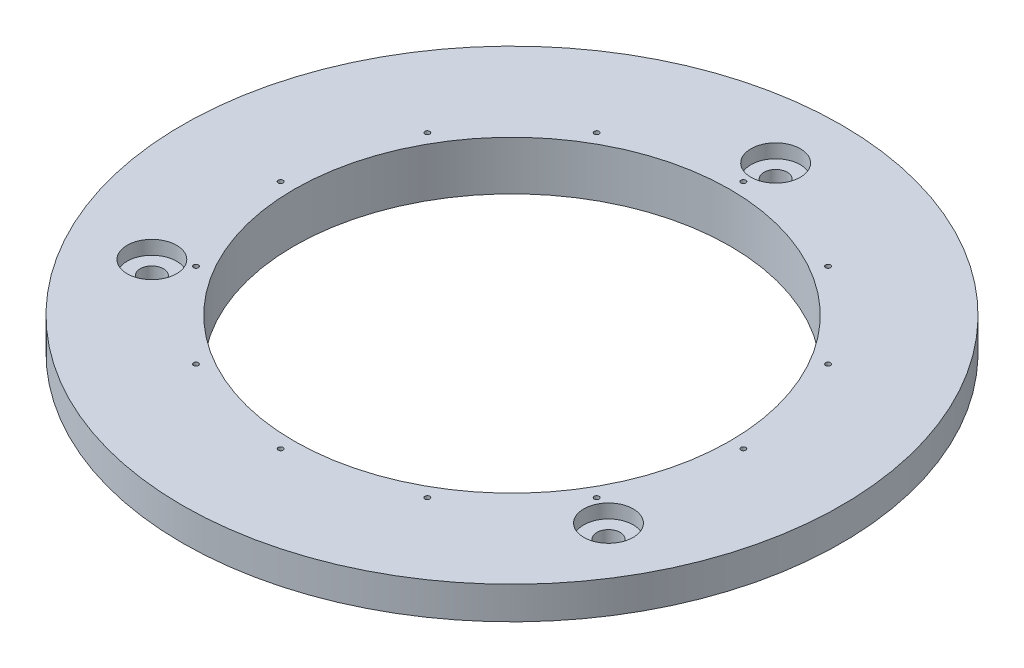
ISO-10303-21;
HEADER;
FILE_DESCRIPTION(('STEP AP214'),'2;1');
FILE_NAME('part.step','',(''),(''),'','','');
FILE_SCHEMA(('AUTOMOTIVE_DESIGN { 1 0 10303 214 1 1 1 1 }'));
ENDSEC;
DATA;
#1=APPLICATION_CONTEXT('core data for automotive mechanical design processes');
#2=APPLICATION_PROTOCOL_DEFINITION('international standard','automotive_design',2000,#1);
#3=PRODUCT_CONTEXT('',#1,'mechanical');
#4=PRODUCT('Part','Part','',(#3));
#5=PRODUCT_RELATED_PRODUCT_CATEGORY('part','',(#4));
#6=PRODUCT_DEFINITION_FORMATION('','',#4);
#7=PRODUCT_DEFINITION_CONTEXT('part definition',#1,'design');
#8=PRODUCT_DEFINITION('design','',#6,#7);
#9=PRODUCT_DEFINITION_SHAPE('','',#8);
#10=(LENGTH_UNIT() NAMED_UNIT(*) SI_UNIT(.MILLI.,.METRE.));
#11=(NAMED_UNIT(*) PLANE_ANGLE_UNIT() SI_UNIT($,.RADIAN.));
#12=(NAMED_UNIT(*) SI_UNIT($,.STERADIAN.) SOLID_ANGLE_UNIT());
#13=UNCERTAINTY_MEASURE_WITH_UNIT(LENGTH_MEASURE(1.E-05),#10,'distance_accuracy_value','');
#14=(GEOMETRIC_REPRESENTATION_CONTEXT(3) GLOBAL_UNCERTAINTY_ASSIGNED_CONTEXT((#13)) GLOBAL_UNIT_ASSIGNED_CONTEXT((#10,
#11,#12)) REPRESENTATION_CONTEXT('',''));
#15=CARTESIAN_POINT('',(0.,0.,0.));
#16=DIRECTION('',(0.,0.,1.));
#17=DIRECTION('',(1.,0.,0.));
#18=AXIS2_PLACEMENT_3D('',#15,#16,#17);
#19=CARTESIAN_POINT('',(0.,0.,0.));
#20=DIRECTION('',(0.,1.,0.));
#21=DIRECTION('',(0.,0.,1.));
#22=AXIS2_PLACEMENT_3D('',#19,#20,#21);
#23=PLANE('',#22);
#24=CARTESIAN_POINT('',(-22.2899357358296,0.,-38.6073011919031));
#25=DIRECTION('',(0.,1.,0.));
#26=DIRECTION('',(0.,0.,1.));
#27=AXIS2_PLACEMENT_3D('',#24,#25,#26);
#28=CIRCLE('',#27,0.475);
#29=CARTESIAN_POINT('',(-22.2899357358296,0.,-38.1323011919031));
#30=VERTEX_POINT('',#29);
#31=EDGE_CURVE('E150',#30,#30,#28,.T.);
#32=ORIENTED_EDGE('',*,*,#31,.T.);
#33=EDGE_LOOP('',(#32));
#34=FACE_BOUND('',#33,.T.);
#35=CARTESIAN_POINT('',(-38.6073011919026,0.,-22.2899357358305));
#36=DIRECTION('',(0.,1.,0.));
#37=DIRECTION('',(0.,0.,1.));
#38=AXIS2_PLACEMENT_3D('',#35,#36,#37);
#39=CIRCLE('',#38,0.474999999999996);
#40=CARTESIAN_POINT('',(-38.6073011919026,0.,-21.8149357358305));
#41=VERTEX_POINT('',#40);
#42=EDGE_CURVE('E154',#41,#41,#39,.T.);
#43=ORIENTED_EDGE('',*,*,#42,.T.);
#44=EDGE_LOOP('',(#43));
#45=FACE_BOUND('',#44,.T.);
#46=CARTESIAN_POINT('',(-44.5798714716601,0.,-4.6694936799398E-13));
#47=DIRECTION('',(0.,1.,0.));
#48=DIRECTION('',(0.,0.,1.));
#49=AXIS2_PLACEMENT_3D('',#46,#47,#48);
#50=CIRCLE('',#49,0.474999999999996);
#51=CARTESIAN_POINT('',(-44.5798714716601,0.,0.474999999999529));
#52=VERTEX_POINT('',#51);
#53=EDGE_CURVE('E158',#52,#52,#50,.T.);
#54=ORIENTED_EDGE('',*,*,#53,.T.);
#55=EDGE_LOOP('',(#54));
#56=FACE_BOUND('',#55,.T.);
#57=CARTESIAN_POINT('',(-38.607301191903,0.,22.2899357358297));
#58=DIRECTION('',(0.,1.,0.));
#59=DIRECTION('',(0.,0.,1.));
#60=AXIS2_PLACEMENT_3D('',#57,#58,#59);
#61=CIRCLE('',#60,0.474999999999996);
#62=CARTESIAN_POINT('',(-38.607301191903,0.,22.7649357358297));
#63=VERTEX_POINT('',#62);
#64=EDGE_CURVE('E162',#63,#63,#61,.T.);
#65=ORIENTED_EDGE('',*,*,#64,.T.);
#66=EDGE_LOOP('',(#65));
#67=FACE_BOUND('',#66,.T.);
#68=CARTESIAN_POINT('',(-22.2899357358304,0.,38.6073011919026));
#69=DIRECTION('',(0.,1.,0.));
#70=DIRECTION('',(0.,0.,1.));
#71=AXIS2_PLACEMENT_3D('',#68,#69,#70);
#72=CIRCLE('',#71,0.475);
#73=CARTESIAN_POINT('',(-22.2899357358304,0.,39.0823011919026));
#74=VERTEX_POINT('',#73);
#75=EDGE_CURVE('E166',#74,#74,#72,.T.);
#76=ORIENTED_EDGE('',*,*,#75,.T.);
#77=EDGE_LOOP('',(#76));
#78=FACE_BOUND('',#77,.T.);
#79=CARTESIAN_POINT('',(0.,0.,44.5798714716601));
#80=DIRECTION('',(0.,1.,0.));
#81=DIRECTION('',(0.,0.,1.));
#82=AXIS2_PLACEMENT_3D('',#79,#80,#81);
#83=CIRCLE('',#82,0.474999999999998);
#84=CARTESIAN_POINT('',(0.,0.,45.0548714716601));
#85=VERTEX_POINT('',#84);
#86=EDGE_CURVE('E170',#85,#85,#83,.T.);
#87=ORIENTED_EDGE('',*,*,#86,.T.);
#88=EDGE_LOOP('',(#87));
#89=FACE_BOUND('',#88,.T.);
#90=CARTESIAN_POINT('',(22.2899357358298,0.,38.6073011919029));
#91=DIRECTION('',(0.,1.,0.));
#92=DIRECTION('',(0.,0.,1.));
#93=AXIS2_PLACEMENT_3D('',#90,#91,#92);
#94=CIRCLE('',#93,0.475);
#95=CARTESIAN_POINT('',(22.2899357358298,0.,39.0823011919029));
#96=VERTEX_POINT('',#95);
#97=EDGE_CURVE('E174',#96,#96,#94,.T.);
#98=ORIENTED_EDGE('',*,*,#97,.T.);
#99=EDGE_LOOP('',(#98));
#100=FACE_BOUND('',#99,.T.);
#101=CARTESIAN_POINT('',(38.6073011919027,0.,22.2899357358302));
#102=DIRECTION('',(0.,1.,0.));
#103=DIRECTION('',(0.,0.,1.));
#104=AXIS2_PLACEMENT_3D('',#101,#102,#103);
#105=CIRCLE('',#104,0.474999999999996);
#106=CARTESIAN_POINT('',(38.6073011919027,0.,22.7649357358302));
#107=VERTEX_POINT('',#106);
#108=EDGE_CURVE('E178',#107,#107,#105,.T.);
#109=ORIENTED_EDGE('',*,*,#108,.T.);
#110=EDGE_LOOP('',(#109));
#111=FACE_BOUND('',#110,.T.);
#112=CARTESIAN_POINT('',(44.5798714716601,0.,1.55649789331327E-13));
#113=DIRECTION('',(0.,1.,0.));
#114=DIRECTION('',(0.,0.,1.));
#115=AXIS2_PLACEMENT_3D('',#112,#113,#114);
#116=CIRCLE('',#115,0.474999999999996);
#117=CARTESIAN_POINT('',(44.5798714716601,0.,0.475000000000152));
#118=VERTEX_POINT('',#117);
#119=EDGE_CURVE('E182',#118,#118,#116,.T.);
#120=ORIENTED_EDGE('',*,*,#119,.T.);
#121=EDGE_LOOP('',(#120));
#122=FACE_BOUND('',#121,.T.);
#123=CARTESIAN_POINT('',(38.6073011919029,0.,-22.28993573583));
#124=DIRECTION('',(0.,1.,0.));
#125=DIRECTION('',(0.,0.,1.));
#126=AXIS2_PLACEMENT_3D('',#123,#124,#125);
#127=CIRCLE('',#126,0.474999999999996);
#128=CARTESIAN_POINT('',(38.6073011919029,0.,-21.81493573583));
#129=VERTEX_POINT('',#128);
#130=EDGE_CURVE('E186',#129,#129,#127,.T.);
#131=ORIENTED_EDGE('',*,*,#130,.T.);
#132=EDGE_LOOP('',(#131));
#133=FACE_BOUND('',#132,.T.);
#134=CARTESIAN_POINT('',(22.2899357358301,0.,-38.6073011919028));
#135=DIRECTION('',(0.,1.,0.));
#136=DIRECTION('',(0.,0.,1.));
#137=AXIS2_PLACEMENT_3D('',#134,#135,#136);
#138=CIRCLE('',#137,0.475);
#139=CARTESIAN_POINT('',(22.2899357358301,0.,-38.1323011919028));
#140=VERTEX_POINT('',#139);
#141=EDGE_CURVE('E190',#140,#140,#138,.T.);
#142=ORIENTED_EDGE('',*,*,#141,.T.);
#143=EDGE_LOOP('',(#142));
#144=FACE_BOUND('',#143,.T.);
#145=CARTESIAN_POINT('',(0.,0.,-44.5798714716601));
#146=DIRECTION('',(0.,1.,0.));
#147=DIRECTION('',(0.,0.,1.));
#148=AXIS2_PLACEMENT_3D('',#145,#146,#147);
#149=CIRCLE('',#148,0.474999999999998);
#150=CARTESIAN_POINT('',(0.,0.,-44.1048714716601));
#151=VERTEX_POINT('',#150);
#152=EDGE_CURVE('E194',#151,#151,#149,.T.);
#153=ORIENTED_EDGE('',*,*,#152,.T.);
#154=EDGE_LOOP('',(#153));
#155=FACE_BOUND('',#154,.T.);
#156=CARTESIAN_POINT('',(-43.9940905122497,0.,25.3999999999996));
#157=DIRECTION('',(0.,1.,0.));
#158=DIRECTION('',(0.,0.,1.));
#159=AXIS2_PLACEMENT_3D('',#156,#157,#158);
#160=CIRCLE('',#159,2.24789999999991);
#161=CARTESIAN_POINT('',(-43.9940905122497,0.,27.6478999999995));
#162=VERTEX_POINT('',#161);
#163=EDGE_CURVE('E50',#162,#162,#160,.T.);
#164=ORIENTED_EDGE('',*,*,#163,.T.);
#165=EDGE_LOOP('',(#164));
#166=FACE_BOUND('',#165,.T.);
#167=CARTESIAN_POINT('',(43.9940905122494,0.,25.4000000000002));
#168=DIRECTION('',(0.,1.,0.));
#169=DIRECTION('',(0.,0.,1.));
#170=AXIS2_PLACEMENT_3D('',#167,#168,#169);
#171=CIRCLE('',#170,2.24789999999991);
#172=CARTESIAN_POINT('',(43.9940905122494,0.,27.6479000000001));
#173=VERTEX_POINT('',#172);
#174=EDGE_CURVE('E72',#173,#173,#171,.T.);
#175=ORIENTED_EDGE('',*,*,#174,.T.);
#176=EDGE_LOOP('',(#175));
#177=FACE_BOUND('',#176,.T.);
#178=CARTESIAN_POINT('',(0.,0.,-50.8));
#179=DIRECTION('',(0.,1.,0.));
#180=DIRECTION('',(0.,0.,1.));
#181=AXIS2_PLACEMENT_3D('',#178,#179,#180);
#182=CIRCLE('',#181,2.24789999999991);
#183=CARTESIAN_POINT('',(0.,0.,-48.5521000000001));
#184=VERTEX_POINT('',#183);
#185=EDGE_CURVE('E67',#184,#184,#182,.T.);
#186=ORIENTED_EDGE('',*,*,#185,.T.);
#187=EDGE_LOOP('',(#186));
#188=FACE_BOUND('',#187,.T.);
#189=CARTESIAN_POINT('',(0.,0.,0.));
#190=DIRECTION('',(0.,1.,0.));
#191=DIRECTION('',(0.,0.,1.));
#192=AXIS2_PLACEMENT_3D('',#189,#190,#191);
#193=CIRCLE('',#192,42.0000049);
#194=CARTESIAN_POINT('',(0.,0.,42.0000049));
#195=VERTEX_POINT('',#194);
#196=EDGE_CURVE('E63',#195,#195,#193,.T.);
#197=ORIENTED_EDGE('',*,*,#196,.T.);
#198=EDGE_LOOP('',(#197));
#199=FACE_BOUND('',#198,.T.);
#200=CARTESIAN_POINT('',(0.,0.,0.));
#201=DIRECTION('',(0.,-1.,0.));
#202=DIRECTION('',(0.,0.,-1.));
#203=AXIS2_PLACEMENT_3D('',#200,#201,#202);
#204=CIRCLE('',#203,58.5911638987099);
#205=CARTESIAN_POINT('',(0.,0.,-58.5911638987099));
#206=VERTEX_POINT('',#205);
#207=EDGE_CURVE('E112',#206,#206,#204,.T.);
#208=ORIENTED_EDGE('',*,*,#207,.T.);
#209=EDGE_LOOP('',(#208));
#210=FACE_BOUND('',#209,.T.);
#211=ADVANCED_FACE('F46',(#34,#45,#56,#67,#78,#89,#100,#111,#122,#133,#144,#155,#166,#177,#188,
#199,#210),#23,.F.);
#212=CARTESIAN_POINT('',(0.,9.449999896,0.));
#213=DIRECTION('',(0.,1.,0.));
#214=DIRECTION('',(0.,0.,1.));
#215=AXIS2_PLACEMENT_3D('',#212,#213,#214);
#216=PLANE('',#215);
#217=CARTESIAN_POINT('',(-22.2899357358296,9.449999896,-38.6073011919031));
#218=DIRECTION('',(0.,1.,0.));
#219=DIRECTION('',(0.,0.,1.));
#220=AXIS2_PLACEMENT_3D('',#217,#218,#219);
#221=CIRCLE('',#220,0.474999999999986);
#222=CARTESIAN_POINT('',(-22.2899357358296,9.449999896,-38.1323011919031));
#223=VERTEX_POINT('',#222);
#224=EDGE_CURVE('E293',#223,#223,#221,.T.);
#225=ORIENTED_EDGE('',*,*,#224,.F.);
#226=EDGE_LOOP('',(#225));
#227=FACE_BOUND('',#226,.T.);
#228=CARTESIAN_POINT('',(-38.6073011919026,9.449999896,-22.2899357358305));
#229=DIRECTION('',(0.,1.,0.));
#230=DIRECTION('',(0.,0.,1.));
#231=AXIS2_PLACEMENT_3D('',#228,#229,#230);
#232=CIRCLE('',#231,0.474999999999989);
#233=CARTESIAN_POINT('',(-38.6073011919026,9.449999896,-21.8149357358305));
#234=VERTEX_POINT('',#233);
#235=EDGE_CURVE('E299',#234,#234,#232,.T.);
#236=ORIENTED_EDGE('',*,*,#235,.F.);
#237=EDGE_LOOP('',(#236));
#238=FACE_BOUND('',#237,.T.);
#239=CARTESIAN_POINT('',(-44.5798714716601,9.449999896,-4.6694936799398E-13));
#240=DIRECTION('',(0.,1.,0.));
#241=DIRECTION('',(0.,0.,1.));
#242=AXIS2_PLACEMENT_3D('',#239,#240,#241);
#243=CIRCLE('',#242,0.474999999999989);
#244=CARTESIAN_POINT('',(-44.5798714716601,9.449999896,0.474999999999522));
#245=VERTEX_POINT('',#244);
#246=EDGE_CURVE('E307',#245,#245,#243,.T.);
#247=ORIENTED_EDGE('',*,*,#246,.F.);
#248=EDGE_LOOP('',(#247));
#249=FACE_BOUND('',#248,.T.);
#250=CARTESIAN_POINT('',(-38.607301191903,9.449999896,22.2899357358297));
#251=DIRECTION('',(0.,1.,0.));
#252=DIRECTION('',(0.,0.,1.));
#253=AXIS2_PLACEMENT_3D('',#250,#251,#252);
#254=CIRCLE('',#253,0.474999999999989);
#255=CARTESIAN_POINT('',(-38.607301191903,9.449999896,22.7649357358297));
#256=VERTEX_POINT('',#255);
#257=EDGE_CURVE('E313',#256,#256,#254,.T.);
#258=ORIENTED_EDGE('',*,*,#257,.F.);
#259=EDGE_LOOP('',(#258));
#260=FACE_BOUND('',#259,.T.);
#261=CARTESIAN_POINT('',(-22.2899357358304,9.449999896,38.6073011919026));
#262=DIRECTION('',(0.,1.,0.));
#263=DIRECTION('',(0.,0.,1.));
#264=AXIS2_PLACEMENT_3D('',#261,#262,#263);
#265=CIRCLE('',#264,0.474999999999986);
#266=CARTESIAN_POINT('',(-22.2899357358304,9.449999896,39.0823011919026));
#267=VERTEX_POINT('',#266);
#268=EDGE_CURVE('E319',#267,#267,#265,.T.);
#269=ORIENTED_EDGE('',*,*,#268,.F.);
#270=EDGE_LOOP('',(#269));
#271=FACE_BOUND('',#270,.T.);
#272=CARTESIAN_POINT('',(0.,9.449999896,44.5798714716601));
#273=DIRECTION('',(0.,1.,0.));
#274=DIRECTION('',(0.,0.,1.));
#275=AXIS2_PLACEMENT_3D('',#272,#273,#274);
#276=CIRCLE('',#275,0.474999999999988);
#277=CARTESIAN_POINT('',(0.,9.449999896,45.0548714716601));
#278=VERTEX_POINT('',#277);
#279=EDGE_CURVE('E325',#278,#278,#276,.T.);
#280=ORIENTED_EDGE('',*,*,#279,.F.);
#281=EDGE_LOOP('',(#280));
#282=FACE_BOUND('',#281,.T.);
#283=CARTESIAN_POINT('',(22.2899357358298,9.449999896,38.6073011919029));
#284=DIRECTION('',(0.,1.,0.));
#285=DIRECTION('',(0.,0.,1.));
#286=AXIS2_PLACEMENT_3D('',#283,#284,#285);
#287=CIRCLE('',#286,0.474999999999986);
#288=CARTESIAN_POINT('',(22.2899357358298,9.449999896,39.0823011919029));
#289=VERTEX_POINT('',#288);
#290=EDGE_CURVE('E331',#289,#289,#287,.T.);
#291=ORIENTED_EDGE('',*,*,#290,.F.);
#292=EDGE_LOOP('',(#291));
#293=FACE_BOUND('',#292,.T.);
#294=CARTESIAN_POINT('',(38.6073011919027,9.449999896,22.2899357358302));
#295=DIRECTION('',(0.,1.,0.));
#296=DIRECTION('',(0.,0.,1.));
#297=AXIS2_PLACEMENT_3D('',#294,#295,#296);
#298=CIRCLE('',#297,0.474999999999989);
#299=CARTESIAN_POINT('',(38.6073011919027,9.449999896,22.7649357358302));
#300=VERTEX_POINT('',#299);
#301=EDGE_CURVE('E337',#300,#300,#298,.T.);
#302=ORIENTED_EDGE('',*,*,#301,.F.);
#303=EDGE_LOOP('',(#302));
#304=FACE_BOUND('',#303,.T.);
#305=CARTESIAN_POINT('',(44.5798714716601,9.449999896,1.55649789331327E-13));
#306=DIRECTION('',(0.,1.,0.));
#307=DIRECTION('',(0.,0.,1.));
#308=AXIS2_PLACEMENT_3D('',#305,#306,#307);
#309=CIRCLE('',#308,0.474999999999989);
#310=CARTESIAN_POINT('',(44.5798714716601,9.449999896,0.475000000000145));
#311=VERTEX_POINT('',#310);
#312=EDGE_CURVE('E343',#311,#311,#309,.T.);
#313=ORIENTED_EDGE('',*,*,#312,.F.);
#314=EDGE_LOOP('',(#313));
#315=FACE_BOUND('',#314,.T.);
#316=CARTESIAN_POINT('',(38.6073011919029,9.449999896,-22.28993573583));
#317=DIRECTION('',(0.,1.,0.));
#318=DIRECTION('',(0.,0.,1.));
#319=AXIS2_PLACEMENT_3D('',#316,#317,#318);
#320=CIRCLE('',#319,0.474999999999989);
#321=CARTESIAN_POINT('',(38.6073011919029,9.449999896,-21.81493573583));
#322=VERTEX_POINT('',#321);
#323=EDGE_CURVE('E349',#322,#322,#320,.T.);
#324=ORIENTED_EDGE('',*,*,#323,.F.);
#325=EDGE_LOOP('',(#324));
#326=FACE_BOUND('',#325,.T.);
#327=CARTESIAN_POINT('',(22.2899357358301,9.449999896,-38.6073011919028));
#328=DIRECTION('',(0.,1.,0.));
#329=DIRECTION('',(0.,0.,1.));
#330=AXIS2_PLACEMENT_3D('',#327,#328,#329);
#331=CIRCLE('',#330,0.474999999999986);
#332=CARTESIAN_POINT('',(22.2899357358301,9.449999896,-38.1323011919028));
#333=VERTEX_POINT('',#332);
#334=EDGE_CURVE('E355',#333,#333,#331,.T.);
#335=ORIENTED_EDGE('',*,*,#334,.F.);
#336=EDGE_LOOP('',(#335));
#337=FACE_BOUND('',#336,.T.);
#338=CARTESIAN_POINT('',(0.,9.449999896,-44.5798714716601));
#339=DIRECTION('',(0.,1.,0.));
#340=DIRECTION('',(0.,0.,1.));
#341=AXIS2_PLACEMENT_3D('',#338,#339,#340);
#342=CIRCLE('',#341,0.474999999999988);
#343=CARTESIAN_POINT('',(0.,9.449999896,-44.1048714716601));
#344=VERTEX_POINT('',#343);
#345=EDGE_CURVE('E361',#344,#344,#342,.T.);
#346=ORIENTED_EDGE('',*,*,#345,.F.);
#347=EDGE_LOOP('',(#346));
#348=FACE_BOUND('',#347,.T.);
#349=CARTESIAN_POINT('',(-43.9940905122497,9.449999896,25.3999999999996));
#350=DIRECTION('',(0.,1.,0.));
#351=DIRECTION('',(0.,0.,1.));
#352=AXIS2_PLACEMENT_3D('',#349,#350,#351);
#353=CIRCLE('',#352,4.7625);
#354=CARTESIAN_POINT('',(-43.9940905122497,9.449999896,30.1624999999996));
#355=VERTEX_POINT('',#354);
#356=EDGE_CURVE('E367',#355,#355,#353,.T.);
#357=ORIENTED_EDGE('',*,*,#356,.F.);
#358=EDGE_LOOP('',(#357));
#359=FACE_BOUND('',#358,.T.);
#360=CARTESIAN_POINT('',(43.9940905122494,9.449999896,25.4000000000002));
#361=DIRECTION('',(0.,1.,0.));
#362=DIRECTION('',(0.,0.,1.));
#363=AXIS2_PLACEMENT_3D('',#360,#361,#362);
#364=CIRCLE('',#363,4.7625);
#365=CARTESIAN_POINT('',(43.9940905122494,9.449999896,30.1625000000002));
#366=VERTEX_POINT('',#365);
#367=EDGE_CURVE('E95',#366,#366,#364,.T.);
#368=ORIENTED_EDGE('',*,*,#367,.F.);
#369=EDGE_LOOP('',(#368));
#370=FACE_BOUND('',#369,.T.);
#371=CARTESIAN_POINT('',(0.,9.449999896,-50.8));
#372=DIRECTION('',(0.,1.,0.));
#373=DIRECTION('',(0.,0.,1.));
#374=AXIS2_PLACEMENT_3D('',#371,#372,#373);
#375=CIRCLE('',#374,4.7625);
#376=CARTESIAN_POINT('',(0.,9.449999896,-46.0375));
#377=VERTEX_POINT('',#376);
#378=EDGE_CURVE('E75',#377,#377,#375,.T.);
#379=ORIENTED_EDGE('',*,*,#378,.F.);
#380=EDGE_LOOP('',(#379));
#381=FACE_BOUND('',#380,.T.);
#382=CARTESIAN_POINT('',(0.,9.449999896,0.));
#383=DIRECTION('',(0.,1.,0.));
#384=DIRECTION('',(0.,0.,1.));
#385=AXIS2_PLACEMENT_3D('',#382,#383,#384);
#386=CIRCLE('',#385,63.5);
#387=CARTESIAN_POINT('',(0.,9.449999896,63.5));
#388=VERTEX_POINT('',#387);
#389=EDGE_CURVE('E10',#388,#388,#386,.T.);
#390=ORIENTED_EDGE('',*,*,#389,.T.);
#391=EDGE_LOOP('',(#390));
#392=FACE_BOUND('',#391,.T.);
#393=CARTESIAN_POINT('',(0.,9.449999896,0.));
#394=DIRECTION('',(0.,1.,0.));
#395=DIRECTION('',(0.,0.,1.));
#396=AXIS2_PLACEMENT_3D('',#393,#394,#395);
#397=CIRCLE('',#396,42.0000049);
#398=CARTESIAN_POINT('',(0.,9.449999896,42.0000049));
#399=VERTEX_POINT('',#398);
#400=EDGE_CURVE('E55',#399,#399,#397,.T.);
#401=ORIENTED_EDGE('',*,*,#400,.F.);
#402=EDGE_LOOP('',(#401));
#403=FACE_BOUND('',#402,.T.);
#404=ADVANCED_FACE('F138',(#227,#238,#249,#260,#271,#282,#293,#304,#315,#326,#337,#348,#359,
#370,#381,#392,#403),#216,.T.);
#405=CARTESIAN_POINT('',(0.,9.449999896,0.));
#406=DIRECTION('',(0.,-1.,0.));
#407=DIRECTION('',(0.,0.,-1.));
#408=AXIS2_PLACEMENT_3D('',#405,#406,#407);
#409=CYLINDRICAL_SURFACE('',#408,63.5);
#410=CARTESIAN_POINT('',(0.,3.175,0.));
#411=DIRECTION('',(0.,-1.,0.));
#412=DIRECTION('',(0.,0.,-1.));
#413=AXIS2_PLACEMENT_3D('',#410,#411,#412);
#414=CIRCLE('',#413,63.5);
#415=CARTESIAN_POINT('',(0.,3.175,-63.5));
#416=VERTEX_POINT('',#415);
#417=EDGE_CURVE('E108',#416,#416,#414,.T.);
#418=ORIENTED_EDGE('',*,*,#417,.F.);
#419=EDGE_LOOP('',(#418));
#420=FACE_BOUND('',#419,.T.);
#421=ORIENTED_EDGE('',*,*,#389,.F.);
#422=EDGE_LOOP('',(#421));
#423=FACE_BOUND('',#422,.T.);
#424=ADVANCED_FACE('F48',(#420,#423),#409,.T.);
#425=CARTESIAN_POINT('',(0.,9.449999896,0.));
#426=DIRECTION('',(0.,-1.,0.));
#427=DIRECTION('',(0.,0.,-1.));
#428=AXIS2_PLACEMENT_3D('',#425,#426,#427);
#429=CYLINDRICAL_SURFACE('',#428,42.0000049);
#430=ORIENTED_EDGE('',*,*,#400,.T.);
#431=EDGE_LOOP('',(#430));
#432=FACE_BOUND('',#431,.T.);
#433=ORIENTED_EDGE('',*,*,#196,.F.);
#434=EDGE_LOOP('',(#433));
#435=FACE_BOUND('',#434,.T.);
#436=ADVANCED_FACE('F126',(#432,#435),#429,.F.);
#437=CARTESIAN_POINT('',(0.,0.,0.));
#438=DIRECTION('',(0.,-1.,0.));
#439=DIRECTION('',(0.,0.,-1.));
#440=AXIS2_PLACEMENT_3D('',#437,#438,#439);
#441=CYLINDRICAL_SURFACE('',#440,58.5911638987099);
#442=CARTESIAN_POINT('',(0.,3.175,0.));
#443=DIRECTION('',(0.,-1.,0.));
#444=DIRECTION('',(0.,0.,-1.));
#445=AXIS2_PLACEMENT_3D('',#442,#443,#444);
#446=CIRCLE('',#445,58.5911638987099);
#447=CARTESIAN_POINT('',(0.,3.175,-58.5911638987099));
#448=VERTEX_POINT('',#447);
#449=EDGE_CURVE('E70',#448,#448,#446,.T.);
#450=ORIENTED_EDGE('',*,*,#449,.T.);
#451=EDGE_LOOP('',(#450));
#452=FACE_BOUND('',#451,.T.);
#453=ORIENTED_EDGE('',*,*,#207,.F.);
#454=EDGE_LOOP('',(#453));
#455=FACE_BOUND('',#454,.T.);
#456=ADVANCED_FACE('F128',(#452,#455),#441,.T.);
#457=CARTESIAN_POINT('',(0.,3.175,0.));
#458=DIRECTION('',(0.,1.,0.));
#459=DIRECTION('',(0.,0.,1.));
#460=AXIS2_PLACEMENT_3D('',#457,#458,#459);
#461=PLANE('',#460);
#462=ORIENTED_EDGE('',*,*,#449,.F.);
#463=EDGE_LOOP('',(#462));
#464=FACE_BOUND('',#463,.T.);
#465=ORIENTED_EDGE('',*,*,#417,.T.);
#466=EDGE_LOOP('',(#465));
#467=FACE_BOUND('',#466,.T.);
#468=ADVANCED_FACE('F135',(#464,#467),#461,.F.);
#469=CARTESIAN_POINT('',(0.,9.449999896,-50.8));
#470=DIRECTION('',(0.,1.,0.));
#471=DIRECTION('',(0.,0.,1.));
#472=AXIS2_PLACEMENT_3D('',#469,#470,#471);
#473=CYLINDRICAL_SURFACE('',#472,2.24789999999991);
#474=CARTESIAN_POINT('',(0.,6.78299989600003,-50.8));
#475=DIRECTION('',(0.,1.,0.));
#476=DIRECTION('',(0.,0.,1.));
#477=AXIS2_PLACEMENT_3D('',#474,#475,#476);
#478=CIRCLE('',#477,2.24789999999994);
#479=CARTESIAN_POINT('',(0.,6.78299989600003,-48.5521000000001));
#480=VERTEX_POINT('',#479);
#481=EDGE_CURVE('E71',#480,#480,#478,.T.);
#482=ORIENTED_EDGE('',*,*,#481,.T.);
#483=EDGE_LOOP('',(#482));
#484=FACE_BOUND('',#483,.T.);
#485=ORIENTED_EDGE('',*,*,#185,.F.);
#486=EDGE_LOOP('',(#485));
#487=FACE_BOUND('',#486,.T.);
#488=ADVANCED_FACE('F200',(#484,#487),#473,.F.);
#489=CARTESIAN_POINT('',(2.24789999999994,6.78299989600001,-50.8));
#490=DIRECTION('',(0.,-1.,0.));
#491=DIRECTION('',(0.,0.,-1.));
#492=AXIS2_PLACEMENT_3D('',#489,#490,#491);
#493=PLANE('',#492);
#494=ORIENTED_EDGE('',*,*,#481,.F.);
#495=EDGE_LOOP('',(#494));
#496=FACE_BOUND('',#495,.T.);
#497=CARTESIAN_POINT('',(0.,6.782999896,-50.8));
#498=DIRECTION('',(0.,1.,0.));
#499=DIRECTION('',(0.,0.,1.));
#500=AXIS2_PLACEMENT_3D('',#497,#498,#499);
#501=CIRCLE('',#500,4.7625);
#502=CARTESIAN_POINT('',(0.,6.782999896,-46.0375));
#503=VERTEX_POINT('',#502);
#504=EDGE_CURVE('E84',#503,#503,#501,.T.);
#505=ORIENTED_EDGE('',*,*,#504,.T.);
#506=EDGE_LOOP('',(#505));
#507=FACE_BOUND('',#506,.T.);
#508=ADVANCED_FACE('F202',(#496,#507),#493,.F.);
#509=CARTESIAN_POINT('',(0.,9.449999896,-50.8));
#510=DIRECTION('',(0.,1.,0.));
#511=DIRECTION('',(0.,0.,1.));
#512=AXIS2_PLACEMENT_3D('',#509,#510,#511);
#513=CYLINDRICAL_SURFACE('',#512,4.7625);
#514=ORIENTED_EDGE('',*,*,#504,.F.);
#515=EDGE_LOOP('',(#514));
#516=FACE_BOUND('',#515,.T.);
#517=ORIENTED_EDGE('',*,*,#378,.T.);
#518=EDGE_LOOP('',(#517));
#519=FACE_BOUND('',#518,.T.);
#520=ADVANCED_FACE('F209',(#516,#519),#513,.F.);
#521=CARTESIAN_POINT('',(43.9940905122494,9.449999896,25.4000000000002));
#522=DIRECTION('',(0.,1.,0.));
#523=DIRECTION('',(0.,0.,1.));
#524=AXIS2_PLACEMENT_3D('',#521,#522,#523);
#525=CYLINDRICAL_SURFACE('',#524,2.24789999999991);
#526=CARTESIAN_POINT('',(43.9940905122494,6.78299989600003,25.4000000000002));
#527=DIRECTION('',(0.,1.,0.));
#528=DIRECTION('',(0.,0.,1.));
#529=AXIS2_PLACEMENT_3D('',#526,#527,#528);
#530=CIRCLE('',#529,2.24789999999993);
#531=CARTESIAN_POINT('',(43.9940905122494,6.78299989600003,27.6479000000001));
#532=VERTEX_POINT('',#531);
#533=EDGE_CURVE('E76',#532,#532,#530,.T.);
#534=ORIENTED_EDGE('',*,*,#533,.T.);
#535=EDGE_LOOP('',(#534));
#536=FACE_BOUND('',#535,.T.);
#537=ORIENTED_EDGE('',*,*,#174,.F.);
#538=EDGE_LOOP('',(#537));
#539=FACE_BOUND('',#538,.T.);
#540=ADVANCED_FACE('F217',(#536,#539),#525,.F.);
#541=CARTESIAN_POINT('',(46.2419905122493,6.78299989600001,25.4000000000002));
#542=DIRECTION('',(0.,-1.,0.));
#543=DIRECTION('',(0.,0.,-1.));
#544=AXIS2_PLACEMENT_3D('',#541,#542,#543);
#545=PLANE('',#544);
#546=ORIENTED_EDGE('',*,*,#533,.F.);
#547=EDGE_LOOP('',(#546));
#548=FACE_BOUND('',#547,.T.);
#549=CARTESIAN_POINT('',(43.9940905122494,6.782999896,25.4000000000002));
#550=DIRECTION('',(0.,1.,0.));
#551=DIRECTION('',(0.,0.,1.));
#552=AXIS2_PLACEMENT_3D('',#549,#550,#551);
#553=CIRCLE('',#552,4.7625);
#554=CARTESIAN_POINT('',(43.9940905122494,6.782999896,30.1625000000002));
#555=VERTEX_POINT('',#554);
#556=EDGE_CURVE('E87',#555,#555,#553,.T.);
#557=ORIENTED_EDGE('',*,*,#556,.T.);
#558=EDGE_LOOP('',(#557));
#559=FACE_BOUND('',#558,.T.);
#560=ADVANCED_FACE('F221',(#548,#559),#545,.F.);
#561=CARTESIAN_POINT('',(43.9940905122494,9.449999896,25.4000000000002));
#562=DIRECTION('',(0.,1.,0.));
#563=DIRECTION('',(0.,0.,1.));
#564=AXIS2_PLACEMENT_3D('',#561,#562,#563);
#565=CYLINDRICAL_SURFACE('',#564,4.7625);
#566=ORIENTED_EDGE('',*,*,#556,.F.);
#567=EDGE_LOOP('',(#566));
#568=FACE_BOUND('',#567,.T.);
#569=ORIENTED_EDGE('',*,*,#367,.T.);
#570=EDGE_LOOP('',(#569));
#571=FACE_BOUND('',#570,.T.);
#572=ADVANCED_FACE('F224',(#568,#571),#565,.F.);
#573=CARTESIAN_POINT('',(-43.9940905122497,9.449999896,25.3999999999996));
#574=DIRECTION('',(0.,1.,0.));
#575=DIRECTION('',(0.,0.,1.));
#576=AXIS2_PLACEMENT_3D('',#573,#574,#575);
#577=CYLINDRICAL_SURFACE('',#576,2.24789999999991);
#578=CARTESIAN_POINT('',(-43.9940905122497,6.78299989600003,25.3999999999996));
#579=DIRECTION('',(0.,1.,0.));
#580=DIRECTION('',(0.,0.,1.));
#581=AXIS2_PLACEMENT_3D('',#578,#579,#580);
#582=CIRCLE('',#581,2.24789999999994);
#583=CARTESIAN_POINT('',(-43.9940905122497,6.78299989600003,27.6478999999995));
#584=VERTEX_POINT('',#583);
#585=EDGE_CURVE('E375',#584,#584,#582,.T.);
#586=ORIENTED_EDGE('',*,*,#585,.T.);
#587=EDGE_LOOP('',(#586));
#588=FACE_BOUND('',#587,.T.);
#589=ORIENTED_EDGE('',*,*,#163,.F.);
#590=EDGE_LOOP('',(#589));
#591=FACE_BOUND('',#590,.T.);
#592=ADVANCED_FACE('F228',(#588,#591),#577,.F.);
#593=CARTESIAN_POINT('',(-41.7461905122498,6.78299989600001,25.3999999999996));
#594=DIRECTION('',(0.,-1.,0.));
#595=DIRECTION('',(0.,0.,-1.));
#596=AXIS2_PLACEMENT_3D('',#593,#594,#595);
#597=PLANE('',#596);
#598=ORIENTED_EDGE('',*,*,#585,.F.);
#599=EDGE_LOOP('',(#598));
#600=FACE_BOUND('',#599,.T.);
#601=CARTESIAN_POINT('',(-43.9940905122497,6.782999896,25.3999999999996));
#602=DIRECTION('',(0.,1.,0.));
#603=DIRECTION('',(0.,0.,1.));
#604=AXIS2_PLACEMENT_3D('',#601,#602,#603);
#605=CIRCLE('',#604,4.7625);
#606=CARTESIAN_POINT('',(-43.9940905122497,6.782999896,30.1624999999996));
#607=VERTEX_POINT('',#606);
#608=EDGE_CURVE('E371',#607,#607,#605,.T.);
#609=ORIENTED_EDGE('',*,*,#608,.T.);
#610=EDGE_LOOP('',(#609));
#611=FACE_BOUND('',#610,.T.);
#612=ADVANCED_FACE('F232',(#600,#611),#597,.F.);
#613=CARTESIAN_POINT('',(-43.9940905122497,9.449999896,25.3999999999996));
#614=DIRECTION('',(0.,1.,0.));
#615=DIRECTION('',(0.,0.,1.));
#616=AXIS2_PLACEMENT_3D('',#613,#614,#615);
#617=CYLINDRICAL_SURFACE('',#616,4.7625);
#618=ORIENTED_EDGE('',*,*,#608,.F.);
#619=EDGE_LOOP('',(#618));
#620=FACE_BOUND('',#619,.T.);
#621=ORIENTED_EDGE('',*,*,#356,.T.);
#622=EDGE_LOOP('',(#621));
#623=FACE_BOUND('',#622,.T.);
#624=ADVANCED_FACE('F236',(#620,#623),#617,.F.);
#625=CARTESIAN_POINT('',(0.,9.449999896,-44.5798714716601));
#626=DIRECTION('',(0.,1.,0.));
#627=DIRECTION('',(0.,0.,1.));
#628=AXIS2_PLACEMENT_3D('',#625,#626,#627);
#629=CYLINDRICAL_SURFACE('',#628,0.474999999999993);
#630=ORIENTED_EDGE('',*,*,#152,.F.);
#631=EDGE_LOOP('',(#630));
#632=FACE_BOUND('',#631,.T.);
#633=ORIENTED_EDGE('',*,*,#345,.T.);
#634=EDGE_LOOP('',(#633));
#635=FACE_BOUND('',#634,.T.);
#636=ADVANCED_FACE('F240',(#632,#635),#629,.F.);
#637=CARTESIAN_POINT('',(22.2899357358301,9.449999896,-38.6073011919028));
#638=DIRECTION('',(0.,1.,0.));
#639=DIRECTION('',(0.,0.,1.));
#640=AXIS2_PLACEMENT_3D('',#637,#638,#639);
#641=CYLINDRICAL_SURFACE('',#640,0.474999999999993);
#642=ORIENTED_EDGE('',*,*,#141,.F.);
#643=EDGE_LOOP('',(#642));
#644=FACE_BOUND('',#643,.T.);
#645=ORIENTED_EDGE('',*,*,#334,.T.);
#646=EDGE_LOOP('',(#645));
#647=FACE_BOUND('',#646,.T.);
#648=ADVANCED_FACE('F244',(#644,#647),#641,.F.);
#649=CARTESIAN_POINT('',(38.6073011919029,9.449999896,-22.28993573583));
#650=DIRECTION('',(0.,1.,0.));
#651=DIRECTION('',(0.,0.,1.));
#652=AXIS2_PLACEMENT_3D('',#649,#650,#651);
#653=CYLINDRICAL_SURFACE('',#652,0.474999999999993);
#654=ORIENTED_EDGE('',*,*,#130,.F.);
#655=EDGE_LOOP('',(#654));
#656=FACE_BOUND('',#655,.T.);
#657=ORIENTED_EDGE('',*,*,#323,.T.);
#658=EDGE_LOOP('',(#657));
#659=FACE_BOUND('',#658,.T.);
#660=ADVANCED_FACE('F248',(#656,#659),#653,.F.);
#661=CARTESIAN_POINT('',(44.5798714716601,9.449999896,1.55649789331327E-13));
#662=DIRECTION('',(0.,1.,0.));
#663=DIRECTION('',(0.,0.,1.));
#664=AXIS2_PLACEMENT_3D('',#661,#662,#663);
#665=CYLINDRICAL_SURFACE('',#664,0.474999999999993);
#666=ORIENTED_EDGE('',*,*,#119,.F.);
#667=EDGE_LOOP('',(#666));
#668=FACE_BOUND('',#667,.T.);
#669=ORIENTED_EDGE('',*,*,#312,.T.);
#670=EDGE_LOOP('',(#669));
#671=FACE_BOUND('',#670,.T.);
#672=ADVANCED_FACE('F252',(#668,#671),#665,.F.);
#673=CARTESIAN_POINT('',(38.6073011919027,9.449999896,22.2899357358302));
#674=DIRECTION('',(0.,1.,0.));
#675=DIRECTION('',(0.,0.,1.));
#676=AXIS2_PLACEMENT_3D('',#673,#674,#675);
#677=CYLINDRICAL_SURFACE('',#676,0.474999999999993);
#678=ORIENTED_EDGE('',*,*,#108,.F.);
#679=EDGE_LOOP('',(#678));
#680=FACE_BOUND('',#679,.T.);
#681=ORIENTED_EDGE('',*,*,#301,.T.);
#682=EDGE_LOOP('',(#681));
#683=FACE_BOUND('',#682,.T.);
#684=ADVANCED_FACE('F256',(#680,#683),#677,.F.);
#685=CARTESIAN_POINT('',(22.2899357358298,9.449999896,38.6073011919029));
#686=DIRECTION('',(0.,1.,0.));
#687=DIRECTION('',(0.,0.,1.));
#688=AXIS2_PLACEMENT_3D('',#685,#686,#687);
#689=CYLINDRICAL_SURFACE('',#688,0.474999999999993);
#690=ORIENTED_EDGE('',*,*,#97,.F.);
#691=EDGE_LOOP('',(#690));
#692=FACE_BOUND('',#691,.T.);
#693=ORIENTED_EDGE('',*,*,#290,.T.);
#694=EDGE_LOOP('',(#693));
#695=FACE_BOUND('',#694,.T.);
#696=ADVANCED_FACE('F260',(#692,#695),#689,.F.);
#697=CARTESIAN_POINT('',(0.,9.449999896,44.5798714716601));
#698=DIRECTION('',(0.,1.,0.));
#699=DIRECTION('',(0.,0.,1.));
#700=AXIS2_PLACEMENT_3D('',#697,#698,#699);
#701=CYLINDRICAL_SURFACE('',#700,0.474999999999993);
#702=ORIENTED_EDGE('',*,*,#86,.F.);
#703=EDGE_LOOP('',(#702));
#704=FACE_BOUND('',#703,.T.);
#705=ORIENTED_EDGE('',*,*,#279,.T.);
#706=EDGE_LOOP('',(#705));
#707=FACE_BOUND('',#706,.T.);
#708=ADVANCED_FACE('F264',(#704,#707),#701,.F.);
#709=CARTESIAN_POINT('',(-22.2899357358304,9.449999896,38.6073011919026));
#710=DIRECTION('',(0.,1.,0.));
#711=DIRECTION('',(0.,0.,1.));
#712=AXIS2_PLACEMENT_3D('',#709,#710,#711);
#713=CYLINDRICAL_SURFACE('',#712,0.474999999999993);
#714=ORIENTED_EDGE('',*,*,#75,.F.);
#715=EDGE_LOOP('',(#714));
#716=FACE_BOUND('',#715,.T.);
#717=ORIENTED_EDGE('',*,*,#268,.T.);
#718=EDGE_LOOP('',(#717));
#719=FACE_BOUND('',#718,.T.);
#720=ADVANCED_FACE('F268',(#716,#719),#713,.F.);
#721=CARTESIAN_POINT('',(-38.607301191903,9.449999896,22.2899357358297));
#722=DIRECTION('',(0.,1.,0.));
#723=DIRECTION('',(0.,0.,1.));
#724=AXIS2_PLACEMENT_3D('',#721,#722,#723);
#725=CYLINDRICAL_SURFACE('',#724,0.474999999999993);
#726=ORIENTED_EDGE('',*,*,#64,.F.);
#727=EDGE_LOOP('',(#726));
#728=FACE_BOUND('',#727,.T.);
#729=ORIENTED_EDGE('',*,*,#257,.T.);
#730=EDGE_LOOP('',(#729));
#731=FACE_BOUND('',#730,.T.);
#732=ADVANCED_FACE('F272',(#728,#731),#725,.F.);
#733=CARTESIAN_POINT('',(-44.5798714716601,9.449999896,-4.6694936799398E-13));
#734=DIRECTION('',(0.,1.,0.));
#735=DIRECTION('',(0.,0.,1.));
#736=AXIS2_PLACEMENT_3D('',#733,#734,#735);
#737=CYLINDRICAL_SURFACE('',#736,0.474999999999993);
#738=ORIENTED_EDGE('',*,*,#53,.F.);
#739=EDGE_LOOP('',(#738));
#740=FACE_BOUND('',#739,.T.);
#741=ORIENTED_EDGE('',*,*,#246,.T.);
#742=EDGE_LOOP('',(#741));
#743=FACE_BOUND('',#742,.T.);
#744=ADVANCED_FACE('F276',(#740,#743),#737,.F.);
#745=CARTESIAN_POINT('',(-38.6073011919026,9.449999896,-22.2899357358305));
#746=DIRECTION('',(0.,1.,0.));
#747=DIRECTION('',(0.,0.,1.));
#748=AXIS2_PLACEMENT_3D('',#745,#746,#747);
#749=CYLINDRICAL_SURFACE('',#748,0.474999999999993);
#750=ORIENTED_EDGE('',*,*,#42,.F.);
#751=EDGE_LOOP('',(#750));
#752=FACE_BOUND('',#751,.T.);
#753=ORIENTED_EDGE('',*,*,#235,.T.);
#754=EDGE_LOOP('',(#753));
#755=FACE_BOUND('',#754,.T.);
#756=ADVANCED_FACE('F280',(#752,#755),#749,.F.);
#757=CARTESIAN_POINT('',(-22.2899357358296,9.449999896,-38.6073011919031));
#758=DIRECTION('',(0.,1.,0.));
#759=DIRECTION('',(0.,0.,1.));
#760=AXIS2_PLACEMENT_3D('',#757,#758,#759);
#761=CYLINDRICAL_SURFACE('',#760,0.474999999999993);
#762=ORIENTED_EDGE('',*,*,#31,.F.);
#763=EDGE_LOOP('',(#762));
#764=FACE_BOUND('',#763,.T.);
#765=ORIENTED_EDGE('',*,*,#224,.T.);
#766=EDGE_LOOP('',(#765));
#767=FACE_BOUND('',#766,.T.);
#768=ADVANCED_FACE('F284',(#764,#767),#761,.F.);
#769=CLOSED_SHELL('',(#211,#404,#424,#436,#456,#468,#488,#508,#520,#540,#560,#572,#592,#612,
#624,#636,#648,#660,#672,#684,#696,#708,#720,#732,#744,#756,#768));
#770=MANIFOLD_SOLID_BREP('B2',#769);
#771=ADVANCED_BREP_SHAPE_REPRESENTATION('',(#18,#770),#14);
#772=SHAPE_DEFINITION_REPRESENTATION(#9,#771);
ENDSEC;
END-ISO-10303-21;
